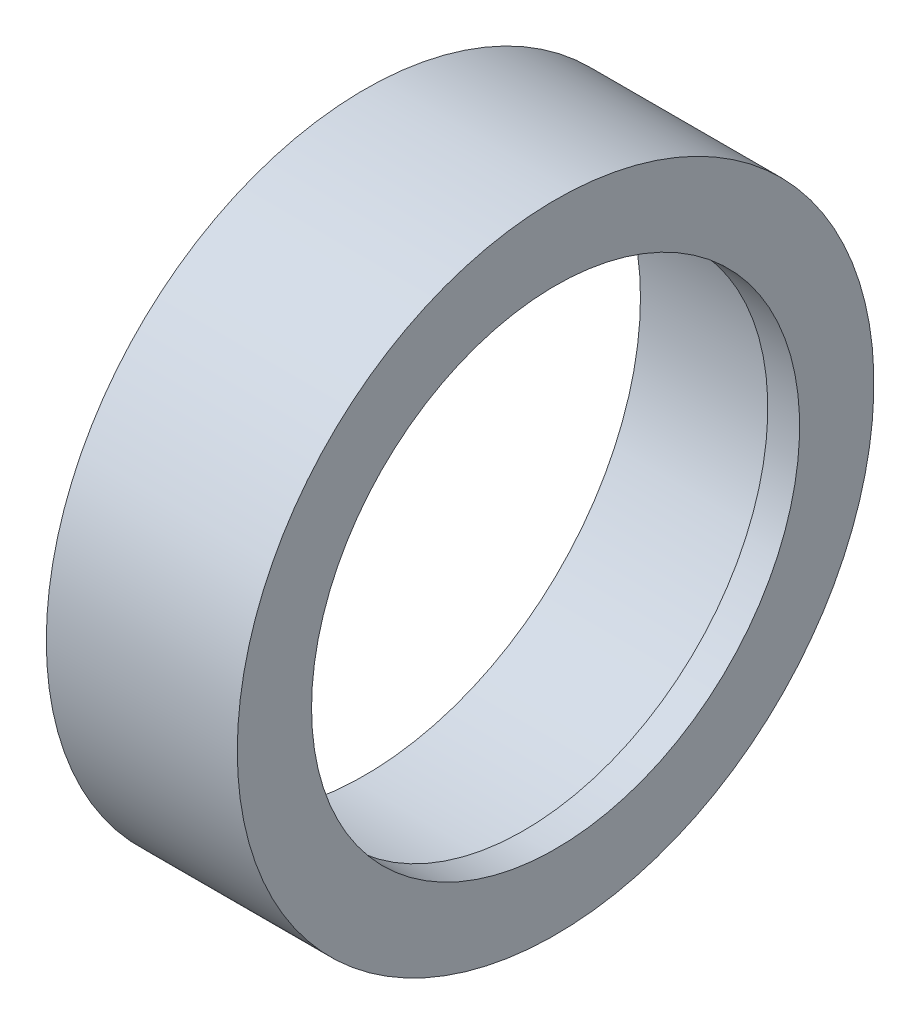
ISO-10303-21;
HEADER;
FILE_DESCRIPTION(('STEP AP214'),'2;1');
FILE_NAME('part.step','',(''),(''),'','','');
FILE_SCHEMA(('AUTOMOTIVE_DESIGN { 1 0 10303 214 1 1 1 1 }'));
ENDSEC;
DATA;
#1=APPLICATION_CONTEXT('core data for automotive mechanical design processes');
#2=APPLICATION_PROTOCOL_DEFINITION('international standard','automotive_design',2000,#1);
#3=PRODUCT_CONTEXT('',#1,'mechanical');
#4=PRODUCT('Part','Part','',(#3));
#5=PRODUCT_RELATED_PRODUCT_CATEGORY('part','',(#4));
#6=PRODUCT_DEFINITION_FORMATION('','',#4);
#7=PRODUCT_DEFINITION_CONTEXT('part definition',#1,'design');
#8=PRODUCT_DEFINITION('design','',#6,#7);
#9=PRODUCT_DEFINITION_SHAPE('','',#8);
#10=(LENGTH_UNIT() NAMED_UNIT(*) SI_UNIT(.MILLI.,.METRE.));
#11=(NAMED_UNIT(*) PLANE_ANGLE_UNIT() SI_UNIT($,.RADIAN.));
#12=(NAMED_UNIT(*) SI_UNIT($,.STERADIAN.) SOLID_ANGLE_UNIT());
#13=UNCERTAINTY_MEASURE_WITH_UNIT(LENGTH_MEASURE(1.E-05),#10,'distance_accuracy_value','');
#14=(GEOMETRIC_REPRESENTATION_CONTEXT(3) GLOBAL_UNCERTAINTY_ASSIGNED_CONTEXT((#13)) GLOBAL_UNIT_ASSIGNED_CONTEXT((#10,
#11,#12)) REPRESENTATION_CONTEXT('',''));
#15=CARTESIAN_POINT('',(0.,0.,0.));
#16=DIRECTION('',(0.,0.,1.));
#17=DIRECTION('',(1.,0.,0.));
#18=AXIS2_PLACEMENT_3D('',#15,#16,#17);
#19=CARTESIAN_POINT('',(-1000.,0.,0.));
#20=DIRECTION('',(-1.,0.,0.));
#21=DIRECTION('',(0.,0.,1.));
#22=AXIS2_PLACEMENT_3D('',#19,#20,#21);
#23=CYLINDRICAL_SURFACE('',#22,26.);
#24=CARTESIAN_POINT('',(0.,0.,0.));
#25=DIRECTION('',(-1.,0.,0.));
#26=DIRECTION('',(0.,0.,1.));
#27=AXIS2_PLACEMENT_3D('',#24,#25,#26);
#28=CIRCLE('',#27,26.);
#29=CARTESIAN_POINT('',(0.,0.,26.));
#30=VERTEX_POINT('',#29);
#31=EDGE_CURVE('E55',#30,#30,#28,.T.);
#32=ORIENTED_EDGE('',*,*,#31,.F.);
#33=EDGE_LOOP('',(#32));
#34=FACE_BOUND('',#33,.T.);
#35=CARTESIAN_POINT('',(-15.,0.,0.));
#36=DIRECTION('',(-1.,0.,0.));
#37=DIRECTION('',(0.,0.,1.));
#38=AXIS2_PLACEMENT_3D('',#35,#36,#37);
#39=CIRCLE('',#38,26.);
#40=CARTESIAN_POINT('',(-15.,0.,26.));
#41=VERTEX_POINT('',#40);
#42=EDGE_CURVE('E10',#41,#41,#39,.T.);
#43=ORIENTED_EDGE('',*,*,#42,.T.);
#44=EDGE_LOOP('',(#43));
#45=FACE_BOUND('',#44,.T.);
#46=ADVANCED_FACE('F33',(#34,#45),#23,.F.);
#47=CARTESIAN_POINT('',(-15.,26.,0.));
#48=DIRECTION('',(1.,0.,0.));
#49=DIRECTION('',(0.,0.,-1.));
#50=AXIS2_PLACEMENT_3D('',#47,#48,#49);
#51=PLANE('',#50);
#52=ORIENTED_EDGE('',*,*,#42,.F.);
#53=EDGE_LOOP('',(#52));
#54=FACE_BOUND('',#53,.T.);
#55=CARTESIAN_POINT('',(-15.,0.,0.));
#56=DIRECTION('',(-1.,0.,0.));
#57=DIRECTION('',(0.,0.,1.));
#58=AXIS2_PLACEMENT_3D('',#55,#56,#57);
#59=CIRCLE('',#58,30.);
#60=CARTESIAN_POINT('',(-15.,0.,30.));
#61=VERTEX_POINT('',#60);
#62=EDGE_CURVE('E39',#61,#61,#59,.T.);
#63=ORIENTED_EDGE('',*,*,#62,.T.);
#64=EDGE_LOOP('',(#63));
#65=FACE_BOUND('',#64,.T.);
#66=ADVANCED_FACE('F62',(#54,#65),#51,.F.);
#67=CARTESIAN_POINT('',(-1000.,0.,0.));
#68=DIRECTION('',(-1.,0.,0.));
#69=DIRECTION('',(0.,0.,1.));
#70=AXIS2_PLACEMENT_3D('',#67,#68,#69);
#71=CYLINDRICAL_SURFACE('',#70,30.);
#72=ORIENTED_EDGE('',*,*,#62,.F.);
#73=EDGE_LOOP('',(#72));
#74=FACE_BOUND('',#73,.T.);
#75=CARTESIAN_POINT('',(2.99999999999989,0.,0.));
#76=DIRECTION('',(-1.,0.,0.));
#77=DIRECTION('',(0.,0.,1.));
#78=AXIS2_PLACEMENT_3D('',#75,#76,#77);
#79=CIRCLE('',#78,30.);
#80=CARTESIAN_POINT('',(2.99999999999989,0.,30.));
#81=VERTEX_POINT('',#80);
#82=EDGE_CURVE('E43',#81,#81,#79,.T.);
#83=ORIENTED_EDGE('',*,*,#82,.T.);
#84=EDGE_LOOP('',(#83));
#85=FACE_BOUND('',#84,.T.);
#86=ADVANCED_FACE('F66',(#74,#85),#71,.T.);
#87=CARTESIAN_POINT('',(3.,30.,0.));
#88=DIRECTION('',(-1.,0.,0.));
#89=DIRECTION('',(0.,0.,1.));
#90=AXIS2_PLACEMENT_3D('',#87,#88,#89);
#91=PLANE('',#90);
#92=ORIENTED_EDGE('',*,*,#82,.F.);
#93=EDGE_LOOP('',(#92));
#94=FACE_BOUND('',#93,.T.);
#95=CARTESIAN_POINT('',(2.99999999999989,0.,0.));
#96=DIRECTION('',(-1.,0.,0.));
#97=DIRECTION('',(0.,0.,1.));
#98=AXIS2_PLACEMENT_3D('',#95,#96,#97);
#99=CIRCLE('',#98,23.);
#100=CARTESIAN_POINT('',(2.99999999999989,0.,23.));
#101=VERTEX_POINT('',#100);
#102=EDGE_CURVE('E47',#101,#101,#99,.T.);
#103=ORIENTED_EDGE('',*,*,#102,.T.);
#104=EDGE_LOOP('',(#103));
#105=FACE_BOUND('',#104,.T.);
#106=ADVANCED_FACE('F71',(#94,#105),#91,.F.);
#107=CARTESIAN_POINT('',(-1000.,0.,0.));
#108=DIRECTION('',(-1.,0.,0.));
#109=DIRECTION('',(0.,0.,1.));
#110=AXIS2_PLACEMENT_3D('',#107,#108,#109);
#111=CYLINDRICAL_SURFACE('',#110,23.);
#112=ORIENTED_EDGE('',*,*,#102,.F.);
#113=EDGE_LOOP('',(#112));
#114=FACE_BOUND('',#113,.T.);
#115=CARTESIAN_POINT('',(0.,0.,0.));
#116=DIRECTION('',(-1.,0.,0.));
#117=DIRECTION('',(0.,0.,1.));
#118=AXIS2_PLACEMENT_3D('',#115,#116,#117);
#119=CIRCLE('',#118,23.);
#120=CARTESIAN_POINT('',(0.,0.,23.));
#121=VERTEX_POINT('',#120);
#122=EDGE_CURVE('E52',#121,#121,#119,.T.);
#123=ORIENTED_EDGE('',*,*,#122,.T.);
#124=EDGE_LOOP('',(#123));
#125=FACE_BOUND('',#124,.T.);
#126=ADVANCED_FACE('F77',(#114,#125),#111,.F.);
#127=CARTESIAN_POINT('',(0.,23.,0.));
#128=DIRECTION('',(1.,0.,0.));
#129=DIRECTION('',(0.,0.,-1.));
#130=AXIS2_PLACEMENT_3D('',#127,#128,#129);
#131=PLANE('',#130);
#132=ORIENTED_EDGE('',*,*,#122,.F.);
#133=EDGE_LOOP('',(#132));
#134=FACE_BOUND('',#133,.T.);
#135=ORIENTED_EDGE('',*,*,#31,.T.);
#136=EDGE_LOOP('',(#135));
#137=FACE_BOUND('',#136,.T.);
#138=ADVANCED_FACE('F59',(#134,#137),#131,.F.);
#139=CLOSED_SHELL('',(#46,#66,#86,#106,#126,#138));
#140=MANIFOLD_SOLID_BREP('B2',#139);
#141=ADVANCED_BREP_SHAPE_REPRESENTATION('',(#18,#140),#14);
#142=SHAPE_DEFINITION_REPRESENTATION(#9,#141);
ENDSEC;
END-ISO-10303-21;
